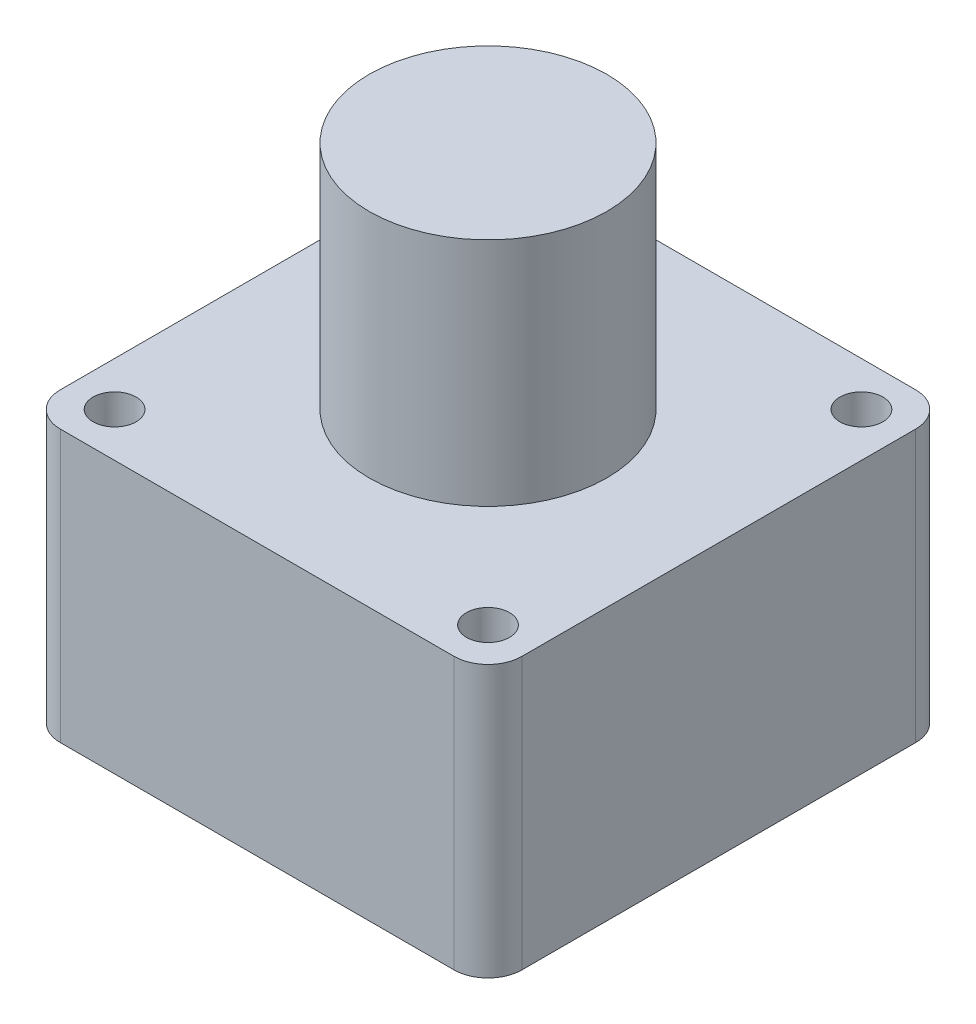
ISO-10303-21;
HEADER;
FILE_DESCRIPTION(('STEP AP214'),'2;1');
FILE_NAME('part.step','',(''),(''),'','','');
FILE_SCHEMA(('AUTOMOTIVE_DESIGN { 1 0 10303 214 1 1 1 1 }'));
ENDSEC;
DATA;
#1=APPLICATION_CONTEXT('core data for automotive mechanical design processes');
#2=APPLICATION_PROTOCOL_DEFINITION('international standard','automotive_design',2000,#1);
#3=PRODUCT_CONTEXT('',#1,'mechanical');
#4=PRODUCT('Part','Part','',(#3));
#5=PRODUCT_RELATED_PRODUCT_CATEGORY('part','',(#4));
#6=PRODUCT_DEFINITION_FORMATION('','',#4);
#7=PRODUCT_DEFINITION_CONTEXT('part definition',#1,'design');
#8=PRODUCT_DEFINITION('design','',#6,#7);
#9=PRODUCT_DEFINITION_SHAPE('','',#8);
#10=(LENGTH_UNIT() NAMED_UNIT(*) SI_UNIT(.MILLI.,.METRE.));
#11=(NAMED_UNIT(*) PLANE_ANGLE_UNIT() SI_UNIT($,.RADIAN.));
#12=(NAMED_UNIT(*) SI_UNIT($,.STERADIAN.) SOLID_ANGLE_UNIT());
#13=UNCERTAINTY_MEASURE_WITH_UNIT(LENGTH_MEASURE(1.E-05),#10,'distance_accuracy_value','');
#14=(GEOMETRIC_REPRESENTATION_CONTEXT(3) GLOBAL_UNCERTAINTY_ASSIGNED_CONTEXT((#13)) GLOBAL_UNIT_ASSIGNED_CONTEXT((#10,
#11,#12)) REPRESENTATION_CONTEXT('',''));
#15=CARTESIAN_POINT('',(0.,0.,0.));
#16=DIRECTION('',(0.,0.,1.));
#17=DIRECTION('',(1.,0.,0.));
#18=AXIS2_PLACEMENT_3D('',#15,#16,#17);
#19=CARTESIAN_POINT('',(-29.,40.,-29.));
#20=DIRECTION('',(0.,-1.,0.));
#21=DIRECTION('',(0.,0.,-1.));
#22=AXIS2_PLACEMENT_3D('',#19,#20,#21);
#23=CYLINDRICAL_SURFACE('',#22,5.);
#24=CARTESIAN_POINT('',(-29.,0.,-29.));
#25=DIRECTION('',(0.,1.,0.));
#26=DIRECTION('',(0.,0.,1.));
#27=AXIS2_PLACEMENT_3D('',#24,#25,#26);
#28=CIRCLE('',#27,5.);
#29=CARTESIAN_POINT('',(-29.,0.,-34.));
#30=VERTEX_POINT('',#29);
#31=CARTESIAN_POINT('',(-34.,0.,-29.));
#32=VERTEX_POINT('',#31);
#33=EDGE_CURVE('E136',#30,#32,#28,.T.);
#34=ORIENTED_EDGE('',*,*,#33,.T.);
#35=DIRECTION('',(0.,-1.,0.));
#36=VECTOR('',#35,1.);
#37=CARTESIAN_POINT('',(-34.,40.,-29.));
#38=LINE('',#37,#36);
#39=CARTESIAN_POINT('',(-34.,40.,-29.));
#40=VERTEX_POINT('',#39);
#41=EDGE_CURVE('E41',#40,#32,#38,.T.);
#42=ORIENTED_EDGE('',*,*,#41,.F.);
#43=CARTESIAN_POINT('',(-29.,40.,-29.));
#44=DIRECTION('',(0.,1.,0.));
#45=DIRECTION('',(0.,0.,1.));
#46=AXIS2_PLACEMENT_3D('',#43,#44,#45);
#47=CIRCLE('',#46,5.);
#48=CARTESIAN_POINT('',(-29.,40.,-34.));
#49=VERTEX_POINT('',#48);
#50=EDGE_CURVE('E154',#49,#40,#47,.T.);
#51=ORIENTED_EDGE('',*,*,#50,.F.);
#52=DIRECTION('',(0.,-1.,0.));
#53=VECTOR('',#52,1.);
#54=CARTESIAN_POINT('',(-29.,40.,-34.));
#55=LINE('',#54,#53);
#56=EDGE_CURVE('E55',#49,#30,#55,.T.);
#57=ORIENTED_EDGE('',*,*,#56,.T.);
#58=EDGE_LOOP('',(#34,#42,#51,#57));
#59=FACE_BOUND('',#58,.T.);
#60=ADVANCED_FACE('F38',(#59),#23,.T.);
#61=CARTESIAN_POINT('',(-34.,40.,-29.));
#62=DIRECTION('',(1.,0.,0.));
#63=DIRECTION('',(0.,0.,-1.));
#64=AXIS2_PLACEMENT_3D('',#61,#62,#63);
#65=PLANE('',#64);
#66=DIRECTION('',(0.,0.,1.));
#67=VECTOR('',#66,1.);
#68=CARTESIAN_POINT('',(-34.,0.,-29.));
#69=LINE('',#68,#67);
#70=CARTESIAN_POINT('',(-34.,0.,29.));
#71=VERTEX_POINT('',#70);
#72=EDGE_CURVE('E138',#32,#71,#69,.T.);
#73=ORIENTED_EDGE('',*,*,#72,.T.);
#74=DIRECTION('',(0.,-1.,0.));
#75=VECTOR('',#74,1.);
#76=CARTESIAN_POINT('',(-34.,40.,29.));
#77=LINE('',#76,#75);
#78=CARTESIAN_POINT('',(-34.,40.,29.));
#79=VERTEX_POINT('',#78);
#80=EDGE_CURVE('E163',#79,#71,#77,.T.);
#81=ORIENTED_EDGE('',*,*,#80,.F.);
#82=DIRECTION('',(0.,0.,1.));
#83=VECTOR('',#82,1.);
#84=CARTESIAN_POINT('',(-34.,40.,-29.));
#85=LINE('',#84,#83);
#86=EDGE_CURVE('E94',#40,#79,#85,.T.);
#87=ORIENTED_EDGE('',*,*,#86,.F.);
#88=ORIENTED_EDGE('',*,*,#41,.T.);
#89=EDGE_LOOP('',(#73,#81,#87,#88));
#90=FACE_BOUND('',#89,.T.);
#91=ADVANCED_FACE('F169',(#90),#65,.F.);
#92=CARTESIAN_POINT('',(-29.,40.,29.));
#93=DIRECTION('',(0.,-1.,0.));
#94=DIRECTION('',(0.,0.,-1.));
#95=AXIS2_PLACEMENT_3D('',#92,#93,#94);
#96=CYLINDRICAL_SURFACE('',#95,5.);
#97=CARTESIAN_POINT('',(-29.,0.,29.));
#98=DIRECTION('',(0.,1.,0.));
#99=DIRECTION('',(0.,0.,1.));
#100=AXIS2_PLACEMENT_3D('',#97,#98,#99);
#101=CIRCLE('',#100,5.);
#102=CARTESIAN_POINT('',(-29.,0.,34.));
#103=VERTEX_POINT('',#102);
#104=EDGE_CURVE('E141',#71,#103,#101,.T.);
#105=ORIENTED_EDGE('',*,*,#104,.T.);
#106=DIRECTION('',(0.,-1.,0.));
#107=VECTOR('',#106,1.);
#108=CARTESIAN_POINT('',(-29.,40.,34.));
#109=LINE('',#108,#107);
#110=CARTESIAN_POINT('',(-29.,40.,34.));
#111=VERTEX_POINT('',#110);
#112=EDGE_CURVE('E161',#111,#103,#109,.T.);
#113=ORIENTED_EDGE('',*,*,#112,.F.);
#114=CARTESIAN_POINT('',(-29.,40.,29.));
#115=DIRECTION('',(0.,1.,0.));
#116=DIRECTION('',(0.,0.,1.));
#117=AXIS2_PLACEMENT_3D('',#114,#115,#116);
#118=CIRCLE('',#117,5.);
#119=EDGE_CURVE('E318',#79,#111,#118,.T.);
#120=ORIENTED_EDGE('',*,*,#119,.F.);
#121=ORIENTED_EDGE('',*,*,#80,.T.);
#122=EDGE_LOOP('',(#105,#113,#120,#121));
#123=FACE_BOUND('',#122,.T.);
#124=ADVANCED_FACE('F187',(#123),#96,.T.);
#125=CARTESIAN_POINT('',(-29.,40.,34.));
#126=DIRECTION('',(0.,0.,-1.));
#127=DIRECTION('',(-1.,0.,0.));
#128=AXIS2_PLACEMENT_3D('',#125,#126,#127);
#129=PLANE('',#128);
#130=DIRECTION('',(1.,0.,0.));
#131=VECTOR('',#130,1.);
#132=CARTESIAN_POINT('',(-29.,0.,34.));
#133=LINE('',#132,#131);
#134=CARTESIAN_POINT('',(29.,0.,34.));
#135=VERTEX_POINT('',#134);
#136=EDGE_CURVE('E143',#103,#135,#133,.T.);
#137=ORIENTED_EDGE('',*,*,#136,.T.);
#138=DIRECTION('',(0.,-1.,0.));
#139=VECTOR('',#138,1.);
#140=CARTESIAN_POINT('',(29.,40.,34.));
#141=LINE('',#140,#139);
#142=CARTESIAN_POINT('',(29.,40.,34.));
#143=VERTEX_POINT('',#142);
#144=EDGE_CURVE('E158',#143,#135,#141,.T.);
#145=ORIENTED_EDGE('',*,*,#144,.F.);
#146=DIRECTION('',(1.,0.,0.));
#147=VECTOR('',#146,1.);
#148=CARTESIAN_POINT('',(-29.,40.,34.));
#149=LINE('',#148,#147);
#150=EDGE_CURVE('E320',#111,#143,#149,.T.);
#151=ORIENTED_EDGE('',*,*,#150,.F.);
#152=ORIENTED_EDGE('',*,*,#112,.T.);
#153=EDGE_LOOP('',(#137,#145,#151,#152));
#154=FACE_BOUND('',#153,.T.);
#155=ADVANCED_FACE('F191',(#154),#129,.F.);
#156=CARTESIAN_POINT('',(29.,40.,29.));
#157=DIRECTION('',(0.,-1.,0.));
#158=DIRECTION('',(0.,0.,-1.));
#159=AXIS2_PLACEMENT_3D('',#156,#157,#158);
#160=CYLINDRICAL_SURFACE('',#159,5.);
#161=CARTESIAN_POINT('',(29.,0.,29.));
#162=DIRECTION('',(0.,1.,0.));
#163=DIRECTION('',(0.,0.,1.));
#164=AXIS2_PLACEMENT_3D('',#161,#162,#163);
#165=CIRCLE('',#164,5.);
#166=CARTESIAN_POINT('',(34.,0.,29.));
#167=VERTEX_POINT('',#166);
#168=EDGE_CURVE('E145',#135,#167,#165,.T.);
#169=ORIENTED_EDGE('',*,*,#168,.T.);
#170=DIRECTION('',(0.,-1.,0.));
#171=VECTOR('',#170,1.);
#172=CARTESIAN_POINT('',(34.,40.,29.));
#173=LINE('',#172,#171);
#174=CARTESIAN_POINT('',(34.,40.,29.));
#175=VERTEX_POINT('',#174);
#176=EDGE_CURVE('E119',#175,#167,#173,.T.);
#177=ORIENTED_EDGE('',*,*,#176,.F.);
#178=CARTESIAN_POINT('',(29.,40.,29.));
#179=DIRECTION('',(0.,1.,0.));
#180=DIRECTION('',(0.,0.,1.));
#181=AXIS2_PLACEMENT_3D('',#178,#179,#180);
#182=CIRCLE('',#181,5.);
#183=EDGE_CURVE('E127',#143,#175,#182,.T.);
#184=ORIENTED_EDGE('',*,*,#183,.F.);
#185=ORIENTED_EDGE('',*,*,#144,.T.);
#186=EDGE_LOOP('',(#169,#177,#184,#185));
#187=FACE_BOUND('',#186,.T.);
#188=ADVANCED_FACE('F196',(#187),#160,.T.);
#189=CARTESIAN_POINT('',(34.,40.,-29.));
#190=DIRECTION('',(1.,0.,0.));
#191=DIRECTION('',(0.,0.,-1.));
#192=AXIS2_PLACEMENT_3D('',#189,#190,#191);
#193=PLANE('',#192);
#194=DIRECTION('',(0.,0.,1.));
#195=VECTOR('',#194,1.);
#196=CARTESIAN_POINT('',(34.,0.,-29.));
#197=LINE('',#196,#195);
#198=CARTESIAN_POINT('',(34.,0.,-29.));
#199=VERTEX_POINT('',#198);
#200=EDGE_CURVE('E115',#199,#167,#197,.T.);
#201=ORIENTED_EDGE('',*,*,#200,.F.);
#202=DIRECTION('',(0.,-1.,0.));
#203=VECTOR('',#202,1.);
#204=CARTESIAN_POINT('',(34.,40.,-29.));
#205=LINE('',#204,#203);
#206=CARTESIAN_POINT('',(34.,40.,-29.));
#207=VERTEX_POINT('',#206);
#208=EDGE_CURVE('E110',#207,#199,#205,.T.);
#209=ORIENTED_EDGE('',*,*,#208,.F.);
#210=DIRECTION('',(0.,0.,1.));
#211=VECTOR('',#210,1.);
#212=CARTESIAN_POINT('',(34.,40.,-29.));
#213=LINE('',#212,#211);
#214=EDGE_CURVE('E113',#207,#175,#213,.T.);
#215=ORIENTED_EDGE('',*,*,#214,.T.);
#216=ORIENTED_EDGE('',*,*,#176,.T.);
#217=EDGE_LOOP('',(#201,#209,#215,#216));
#218=FACE_BOUND('',#217,.T.);
#219=ADVANCED_FACE('F112',(#218),#193,.T.);
#220=CARTESIAN_POINT('',(29.,40.,-29.));
#221=DIRECTION('',(0.,-1.,0.));
#222=DIRECTION('',(0.,0.,-1.));
#223=AXIS2_PLACEMENT_3D('',#220,#221,#222);
#224=CYLINDRICAL_SURFACE('',#223,5.);
#225=CARTESIAN_POINT('',(29.,0.,-29.));
#226=DIRECTION('',(0.,-1.,0.));
#227=DIRECTION('',(0.,0.,-1.));
#228=AXIS2_PLACEMENT_3D('',#225,#226,#227);
#229=CIRCLE('',#228,5.);
#230=CARTESIAN_POINT('',(29.,0.,-34.));
#231=VERTEX_POINT('',#230);
#232=EDGE_CURVE('E149',#231,#199,#229,.T.);
#233=ORIENTED_EDGE('',*,*,#232,.F.);
#234=DIRECTION('',(0.,-1.,0.));
#235=VECTOR('',#234,1.);
#236=CARTESIAN_POINT('',(29.,40.,-34.));
#237=LINE('',#236,#235);
#238=CARTESIAN_POINT('',(29.,40.,-34.));
#239=VERTEX_POINT('',#238);
#240=EDGE_CURVE('E81',#239,#231,#237,.T.);
#241=ORIENTED_EDGE('',*,*,#240,.F.);
#242=CARTESIAN_POINT('',(29.,40.,-29.));
#243=DIRECTION('',(0.,-1.,0.));
#244=DIRECTION('',(0.,0.,-1.));
#245=AXIS2_PLACEMENT_3D('',#242,#243,#244);
#246=CIRCLE('',#245,5.);
#247=EDGE_CURVE('E125',#239,#207,#246,.T.);
#248=ORIENTED_EDGE('',*,*,#247,.T.);
#249=ORIENTED_EDGE('',*,*,#208,.T.);
#250=EDGE_LOOP('',(#233,#241,#248,#249));
#251=FACE_BOUND('',#250,.T.);
#252=ADVANCED_FACE('F130',(#251),#224,.T.);
#253=CARTESIAN_POINT('',(-29.,40.,-34.));
#254=DIRECTION('',(0.,0.,-1.));
#255=DIRECTION('',(-1.,0.,0.));
#256=AXIS2_PLACEMENT_3D('',#253,#254,#255);
#257=PLANE('',#256);
#258=DIRECTION('',(1.,0.,0.));
#259=VECTOR('',#258,1.);
#260=CARTESIAN_POINT('',(-29.,0.,-34.));
#261=LINE('',#260,#259);
#262=EDGE_CURVE('E151',#30,#231,#261,.T.);
#263=ORIENTED_EDGE('',*,*,#262,.F.);
#264=ORIENTED_EDGE('',*,*,#56,.F.);
#265=DIRECTION('',(1.,0.,0.));
#266=VECTOR('',#265,1.);
#267=CARTESIAN_POINT('',(-29.,40.,-34.));
#268=LINE('',#267,#266);
#269=EDGE_CURVE('E131',#49,#239,#268,.T.);
#270=ORIENTED_EDGE('',*,*,#269,.T.);
#271=ORIENTED_EDGE('',*,*,#240,.T.);
#272=EDGE_LOOP('',(#263,#264,#270,#271));
#273=FACE_BOUND('',#272,.T.);
#274=ADVANCED_FACE('F172',(#273),#257,.T.);
#275=CARTESIAN_POINT('',(-29.,40.,-29.));
#276=DIRECTION('',(0.,1.,0.));
#277=DIRECTION('',(0.,0.,1.));
#278=AXIS2_PLACEMENT_3D('',#275,#276,#277);
#279=PLANE('',#278);
#280=CARTESIAN_POINT('',(27.5,40.,-27.5));
#281=DIRECTION('',(0.,1.,0.));
#282=DIRECTION('',(0.,0.,-1.));
#283=AXIS2_PLACEMENT_3D('',#280,#281,#282);
#284=CIRCLE('',#283,3.16747945535428);
#285=CARTESIAN_POINT('',(27.5,40.,-30.6674794553543));
#286=VERTEX_POINT('',#285);
#287=EDGE_CURVE('E295',#286,#286,#284,.T.);
#288=ORIENTED_EDGE('',*,*,#287,.F.);
#289=EDGE_LOOP('',(#288));
#290=FACE_BOUND('',#289,.T.);
#291=CARTESIAN_POINT('',(-27.5,40.,27.5));
#292=DIRECTION('',(0.,1.,0.));
#293=DIRECTION('',(0.,0.,-1.));
#294=AXIS2_PLACEMENT_3D('',#291,#292,#293);
#295=CIRCLE('',#294,3.16747945535428);
#296=CARTESIAN_POINT('',(-27.5,40.,24.3325205446457));
#297=VERTEX_POINT('',#296);
#298=EDGE_CURVE('E299',#297,#297,#295,.T.);
#299=ORIENTED_EDGE('',*,*,#298,.F.);
#300=EDGE_LOOP('',(#299));
#301=FACE_BOUND('',#300,.T.);
#302=CARTESIAN_POINT('',(27.5,40.,27.5));
#303=DIRECTION('',(0.,1.,0.));
#304=DIRECTION('',(0.,0.,1.));
#305=AXIS2_PLACEMENT_3D('',#302,#303,#304);
#306=CIRCLE('',#305,3.16747945535428);
#307=CARTESIAN_POINT('',(27.5,40.,30.6674794553543));
#308=VERTEX_POINT('',#307);
#309=EDGE_CURVE('E335',#308,#308,#306,.T.);
#310=ORIENTED_EDGE('',*,*,#309,.F.);
#311=EDGE_LOOP('',(#310));
#312=FACE_BOUND('',#311,.T.);
#313=CARTESIAN_POINT('',(-27.5,40.,-27.5));
#314=DIRECTION('',(0.,1.,0.));
#315=DIRECTION('',(0.,0.,1.));
#316=AXIS2_PLACEMENT_3D('',#313,#314,#315);
#317=CIRCLE('',#316,3.16747945535428);
#318=CARTESIAN_POINT('',(-27.5,40.,-24.3325205446457));
#319=VERTEX_POINT('',#318);
#320=EDGE_CURVE('E307',#319,#319,#317,.T.);
#321=ORIENTED_EDGE('',*,*,#320,.F.);
#322=EDGE_LOOP('',(#321));
#323=FACE_BOUND('',#322,.T.);
#324=CARTESIAN_POINT('',(0.,40.,0.));
#325=DIRECTION('',(0.,1.,0.));
#326=DIRECTION('',(0.,0.,1.));
#327=AXIS2_PLACEMENT_3D('',#324,#325,#326);
#328=CIRCLE('',#327,17.5);
#329=CARTESIAN_POINT('',(0.,40.,17.5));
#330=VERTEX_POINT('',#329);
#331=EDGE_CURVE('E11',#330,#330,#328,.T.);
#332=ORIENTED_EDGE('',*,*,#331,.F.);
#333=EDGE_LOOP('',(#332));
#334=FACE_BOUND('',#333,.T.);
#335=ORIENTED_EDGE('',*,*,#50,.T.);
#336=ORIENTED_EDGE('',*,*,#86,.T.);
#337=ORIENTED_EDGE('',*,*,#119,.T.);
#338=ORIENTED_EDGE('',*,*,#150,.T.);
#339=ORIENTED_EDGE('',*,*,#183,.T.);
#340=ORIENTED_EDGE('',*,*,#214,.F.);
#341=ORIENTED_EDGE('',*,*,#247,.F.);
#342=ORIENTED_EDGE('',*,*,#269,.F.);
#343=EDGE_LOOP('',(#335,#336,#337,#338,#339,#340,#341,#342));
#344=FACE_BOUND('',#343,.T.);
#345=ADVANCED_FACE('F123',(#290,#301,#312,#323,#334,#344),#279,.T.);
#346=CARTESIAN_POINT('',(-29.,0.,-29.));
#347=DIRECTION('',(0.,1.,0.));
#348=DIRECTION('',(0.,0.,1.));
#349=AXIS2_PLACEMENT_3D('',#346,#347,#348);
#350=PLANE('',#349);
#351=CARTESIAN_POINT('',(27.5,0.,-27.5));
#352=DIRECTION('',(0.,1.,0.));
#353=DIRECTION('',(0.,0.,1.));
#354=AXIS2_PLACEMENT_3D('',#351,#352,#353);
#355=CIRCLE('',#354,3.16747945535428);
#356=CARTESIAN_POINT('',(27.5,0.,-24.3325205446457));
#357=VERTEX_POINT('',#356);
#358=EDGE_CURVE('E298',#357,#357,#355,.F.);
#359=ORIENTED_EDGE('',*,*,#358,.F.);
#360=EDGE_LOOP('',(#359));
#361=FACE_BOUND('',#360,.T.);
#362=CARTESIAN_POINT('',(-27.5,0.,27.5));
#363=DIRECTION('',(0.,1.,0.));
#364=DIRECTION('',(0.,0.,1.));
#365=AXIS2_PLACEMENT_3D('',#362,#363,#364);
#366=CIRCLE('',#365,3.16747945535428);
#367=CARTESIAN_POINT('',(-27.5,0.,30.6674794553543));
#368=VERTEX_POINT('',#367);
#369=EDGE_CURVE('E302',#368,#368,#366,.F.);
#370=ORIENTED_EDGE('',*,*,#369,.F.);
#371=EDGE_LOOP('',(#370));
#372=FACE_BOUND('',#371,.T.);
#373=CARTESIAN_POINT('',(27.5,0.,27.5));
#374=DIRECTION('',(0.,1.,0.));
#375=DIRECTION('',(0.,0.,1.));
#376=AXIS2_PLACEMENT_3D('',#373,#374,#375);
#377=CIRCLE('',#376,3.16747945535428);
#378=CARTESIAN_POINT('',(27.5,0.,30.6674794553543));
#379=VERTEX_POINT('',#378);
#380=EDGE_CURVE('E311',#379,#379,#377,.F.);
#381=ORIENTED_EDGE('',*,*,#380,.F.);
#382=EDGE_LOOP('',(#381));
#383=FACE_BOUND('',#382,.T.);
#384=CARTESIAN_POINT('',(-27.5,0.,-27.5));
#385=DIRECTION('',(0.,1.,0.));
#386=DIRECTION('',(0.,0.,1.));
#387=AXIS2_PLACEMENT_3D('',#384,#385,#386);
#388=CIRCLE('',#387,3.16747945535428);
#389=CARTESIAN_POINT('',(-27.5,0.,-24.3325205446457));
#390=VERTEX_POINT('',#389);
#391=EDGE_CURVE('E310',#390,#390,#388,.F.);
#392=ORIENTED_EDGE('',*,*,#391,.F.);
#393=EDGE_LOOP('',(#392));
#394=FACE_BOUND('',#393,.T.);
#395=ORIENTED_EDGE('',*,*,#33,.F.);
#396=ORIENTED_EDGE('',*,*,#262,.T.);
#397=ORIENTED_EDGE('',*,*,#232,.T.);
#398=ORIENTED_EDGE('',*,*,#200,.T.);
#399=ORIENTED_EDGE('',*,*,#168,.F.);
#400=ORIENTED_EDGE('',*,*,#136,.F.);
#401=ORIENTED_EDGE('',*,*,#104,.F.);
#402=ORIENTED_EDGE('',*,*,#72,.F.);
#403=EDGE_LOOP('',(#395,#396,#397,#398,#399,#400,#401,#402));
#404=FACE_BOUND('',#403,.T.);
#405=ADVANCED_FACE('F171',(#361,#372,#383,#394,#404),#350,.F.);
#406=CARTESIAN_POINT('',(0.,74.,0.));
#407=DIRECTION('',(0.,-1.,0.));
#408=DIRECTION('',(0.,0.,-1.));
#409=AXIS2_PLACEMENT_3D('',#406,#407,#408);
#410=CYLINDRICAL_SURFACE('',#409,17.5);
#411=CARTESIAN_POINT('',(0.,74.,0.));
#412=DIRECTION('',(0.,1.,0.));
#413=DIRECTION('',(0.,0.,1.));
#414=AXIS2_PLACEMENT_3D('',#411,#412,#413);
#415=CIRCLE('',#414,17.5);
#416=CARTESIAN_POINT('',(0.,74.,17.5));
#417=VERTEX_POINT('',#416);
#418=EDGE_CURVE('E139',#417,#417,#415,.T.);
#419=ORIENTED_EDGE('',*,*,#418,.F.);
#420=EDGE_LOOP('',(#419));
#421=FACE_BOUND('',#420,.T.);
#422=ORIENTED_EDGE('',*,*,#331,.T.);
#423=EDGE_LOOP('',(#422));
#424=FACE_BOUND('',#423,.T.);
#425=ADVANCED_FACE('F220',(#421,#424),#410,.T.);
#426=CARTESIAN_POINT('',(0.,74.,0.));
#427=DIRECTION('',(0.,1.,0.));
#428=DIRECTION('',(0.,0.,1.));
#429=AXIS2_PLACEMENT_3D('',#426,#427,#428);
#430=PLANE('',#429);
#431=ORIENTED_EDGE('',*,*,#418,.T.);
#432=EDGE_LOOP('',(#431));
#433=FACE_BOUND('',#432,.T.);
#434=ADVANCED_FACE('F225',(#433),#430,.T.);
#435=CARTESIAN_POINT('',(-27.5,-0.001000000000001,-27.5));
#436=DIRECTION('',(0.,1.,0.));
#437=DIRECTION('',(0.,0.,1.));
#438=AXIS2_PLACEMENT_3D('',#435,#436,#437);
#439=CYLINDRICAL_SURFACE('',#438,3.16747945535428);
#440=ORIENTED_EDGE('',*,*,#320,.T.);
#441=EDGE_LOOP('',(#440));
#442=FACE_BOUND('',#441,.T.);
#443=ORIENTED_EDGE('',*,*,#391,.T.);
#444=EDGE_LOOP('',(#443));
#445=FACE_BOUND('',#444,.T.);
#446=ADVANCED_FACE('F237',(#442,#445),#439,.F.);
#447=CARTESIAN_POINT('',(27.5,-0.001000000000001,27.5));
#448=DIRECTION('',(0.,1.,0.));
#449=DIRECTION('',(0.,0.,1.));
#450=AXIS2_PLACEMENT_3D('',#447,#448,#449);
#451=CYLINDRICAL_SURFACE('',#450,3.16747945535428);
#452=ORIENTED_EDGE('',*,*,#309,.T.);
#453=EDGE_LOOP('',(#452));
#454=FACE_BOUND('',#453,.T.);
#455=ORIENTED_EDGE('',*,*,#380,.T.);
#456=EDGE_LOOP('',(#455));
#457=FACE_BOUND('',#456,.T.);
#458=ADVANCED_FACE('F258',(#454,#457),#451,.F.);
#459=CARTESIAN_POINT('',(-27.5,-0.001000000000001,27.5));
#460=DIRECTION('',(0.,1.,0.));
#461=DIRECTION('',(0.,0.,1.));
#462=AXIS2_PLACEMENT_3D('',#459,#460,#461);
#463=CYLINDRICAL_SURFACE('',#462,3.16747945535428);
#464=ORIENTED_EDGE('',*,*,#298,.T.);
#465=EDGE_LOOP('',(#464));
#466=FACE_BOUND('',#465,.T.);
#467=ORIENTED_EDGE('',*,*,#369,.T.);
#468=EDGE_LOOP('',(#467));
#469=FACE_BOUND('',#468,.T.);
#470=ADVANCED_FACE('F268',(#466,#469),#463,.F.);
#471=CARTESIAN_POINT('',(27.5,-0.001000000000001,-27.5));
#472=DIRECTION('',(0.,1.,0.));
#473=DIRECTION('',(0.,0.,1.));
#474=AXIS2_PLACEMENT_3D('',#471,#472,#473);
#475=CYLINDRICAL_SURFACE('',#474,3.16747945535428);
#476=ORIENTED_EDGE('',*,*,#287,.T.);
#477=EDGE_LOOP('',(#476));
#478=FACE_BOUND('',#477,.T.);
#479=ORIENTED_EDGE('',*,*,#358,.T.);
#480=EDGE_LOOP('',(#479));
#481=FACE_BOUND('',#480,.T.);
#482=ADVANCED_FACE('F278',(#478,#481),#475,.F.);
#483=CLOSED_SHELL('',(#60,#91,#124,#155,#188,#219,#252,#274,#345,#405,#425,#434,#446,#458,#470,#482));
#484=MANIFOLD_SOLID_BREP('B2',#483);
#485=ADVANCED_BREP_SHAPE_REPRESENTATION('',(#18,#484),#14);
#486=SHAPE_DEFINITION_REPRESENTATION(#9,#485);
ENDSEC;
END-ISO-10303-21;
